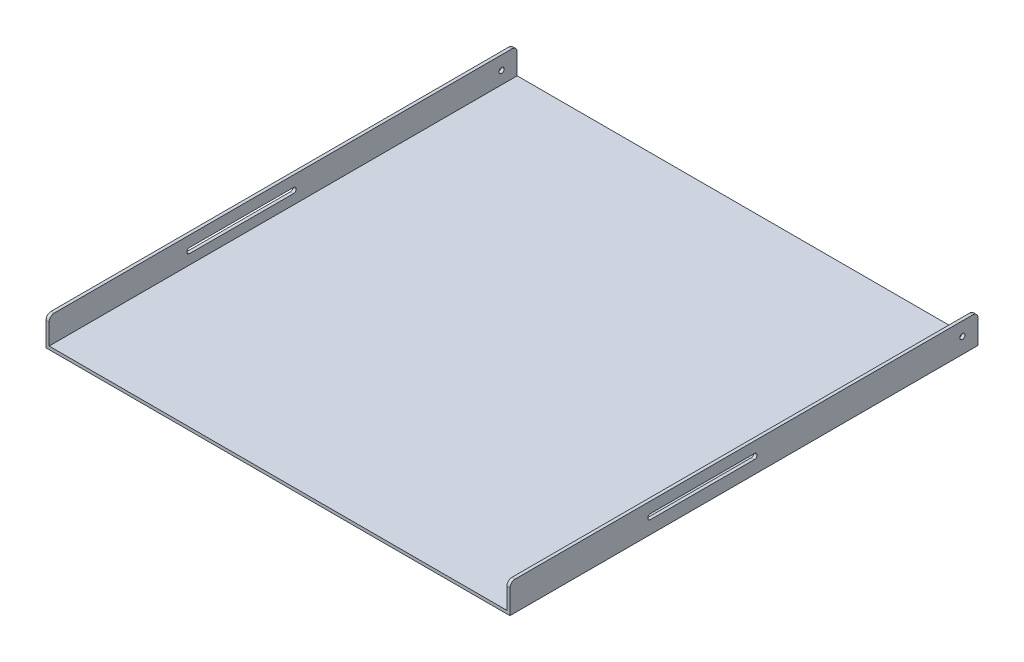
ISO-10303-21;
HEADER;
FILE_DESCRIPTION(('STEP AP214'),'2;1');
FILE_NAME('part.step','',(''),(''),'','','');
FILE_SCHEMA(('AUTOMOTIVE_DESIGN { 1 0 10303 214 1 1 1 1 }'));
ENDSEC;
DATA;
#1=APPLICATION_CONTEXT('core data for automotive mechanical design processes');
#2=APPLICATION_PROTOCOL_DEFINITION('international standard','automotive_design',2000,#1);
#3=PRODUCT_CONTEXT('',#1,'mechanical');
#4=PRODUCT('Part','Part','',(#3));
#5=PRODUCT_RELATED_PRODUCT_CATEGORY('part','',(#4));
#6=PRODUCT_DEFINITION_FORMATION('','',#4);
#7=PRODUCT_DEFINITION_CONTEXT('part definition',#1,'design');
#8=PRODUCT_DEFINITION('design','',#6,#7);
#9=PRODUCT_DEFINITION_SHAPE('','',#8);
#10=(LENGTH_UNIT() NAMED_UNIT(*) SI_UNIT(.MILLI.,.METRE.));
#11=(NAMED_UNIT(*) PLANE_ANGLE_UNIT() SI_UNIT($,.RADIAN.));
#12=(NAMED_UNIT(*) SI_UNIT($,.STERADIAN.) SOLID_ANGLE_UNIT());
#13=UNCERTAINTY_MEASURE_WITH_UNIT(LENGTH_MEASURE(1.E-05),#10,'distance_accuracy_value','');
#14=(GEOMETRIC_REPRESENTATION_CONTEXT(3) GLOBAL_UNCERTAINTY_ASSIGNED_CONTEXT((#13)) GLOBAL_UNIT_ASSIGNED_CONTEXT((#10,
#11,#12)) REPRESENTATION_CONTEXT('',''));
#15=CARTESIAN_POINT('',(0.,0.,0.));
#16=DIRECTION('',(0.,0.,1.));
#17=DIRECTION('',(1.,0.,0.));
#18=AXIS2_PLACEMENT_3D('',#15,#16,#17);
#19=CARTESIAN_POINT('',(636.,0.,450.));
#20=DIRECTION('',(-1.,0.,0.));
#21=DIRECTION('',(0.,0.,1.));
#22=AXIS2_PLACEMENT_3D('',#19,#20,#21);
#23=PLANE('',#22);
#24=CARTESIAN_POINT('',(636.,24.,-420.));
#25=DIRECTION('',(1.,0.,0.));
#26=DIRECTION('',(0.,0.,-1.));
#27=AXIS2_PLACEMENT_3D('',#24,#25,#26);
#28=CIRCLE('',#27,4.99999999999999);
#29=CARTESIAN_POINT('',(636.,24.,-425.));
#30=VERTEX_POINT('',#29);
#31=EDGE_CURVE('E213',#30,#30,#28,.T.);
#32=ORIENTED_EDGE('',*,*,#31,.F.);
#33=EDGE_LOOP('',(#32));
#34=FACE_BOUND('',#33,.T.);
#35=DIRECTION('',(0.,0.,1.));
#36=VECTOR('',#35,1.);
#37=CARTESIAN_POINT('',(636.,29.,-20.));
#38=LINE('',#37,#36);
#39=CARTESIAN_POINT('',(636.,29.,-20.));
#40=VERTEX_POINT('',#39);
#41=CARTESIAN_POINT('',(636.,29.,180.));
#42=VERTEX_POINT('',#41);
#43=EDGE_CURVE('E211',#40,#42,#38,.T.);
#44=ORIENTED_EDGE('',*,*,#43,.F.);
#45=CARTESIAN_POINT('',(636.,24.,-20.));
#46=DIRECTION('',(1.,0.,0.));
#47=DIRECTION('',(0.,0.,-1.));
#48=AXIS2_PLACEMENT_3D('',#45,#46,#47);
#49=CIRCLE('',#48,5.);
#50=CARTESIAN_POINT('',(636.,19.,-20.));
#51=VERTEX_POINT('',#50);
#52=EDGE_CURVE('E187',#51,#40,#49,.T.);
#53=ORIENTED_EDGE('',*,*,#52,.F.);
#54=DIRECTION('',(0.,0.,-1.));
#55=VECTOR('',#54,1.);
#56=CARTESIAN_POINT('',(636.,19.,-20.));
#57=LINE('',#56,#55);
#58=CARTESIAN_POINT('',(636.,19.,180.));
#59=VERTEX_POINT('',#58);
#60=EDGE_CURVE('E197',#59,#51,#57,.T.);
#61=ORIENTED_EDGE('',*,*,#60,.F.);
#62=CARTESIAN_POINT('',(636.,24.,180.));
#63=DIRECTION('',(1.,0.,0.));
#64=DIRECTION('',(0.,0.,-1.));
#65=AXIS2_PLACEMENT_3D('',#62,#63,#64);
#66=CIRCLE('',#65,5.);
#67=EDGE_CURVE('E205',#42,#59,#66,.T.);
#68=ORIENTED_EDGE('',*,*,#67,.F.);
#69=EDGE_LOOP('',(#44,#53,#61,#68));
#70=FACE_BOUND('',#69,.T.);
#71=DIRECTION('',(0.,1.,0.));
#72=VECTOR('',#71,1.);
#73=CARTESIAN_POINT('',(636.,0.,-450.));
#74=LINE('',#73,#72);
#75=CARTESIAN_POINT('',(636.,-6.,-450.));
#76=VERTEX_POINT('',#75);
#77=CARTESIAN_POINT('',(636.,40.,-450.));
#78=VERTEX_POINT('',#77);
#79=EDGE_CURVE('E272',#76,#78,#74,.T.);
#80=ORIENTED_EDGE('',*,*,#79,.T.);
#81=CARTESIAN_POINT('',(636.,40.,-440.));
#82=DIRECTION('',(-1.,0.,0.));
#83=DIRECTION('',(0.,0.,1.));
#84=AXIS2_PLACEMENT_3D('',#81,#82,#83);
#85=CIRCLE('',#84,10.);
#86=CARTESIAN_POINT('',(636.,50.,-440.));
#87=VERTEX_POINT('',#86);
#88=EDGE_CURVE('E371',#78,#87,#85,.F.);
#89=ORIENTED_EDGE('',*,*,#88,.T.);
#90=DIRECTION('',(0.,0.,-1.));
#91=VECTOR('',#90,1.);
#92=CARTESIAN_POINT('',(636.,50.,450.));
#93=LINE('',#92,#91);
#94=CARTESIAN_POINT('',(636.,50.,440.));
#95=VERTEX_POINT('',#94);
#96=EDGE_CURVE('E338',#95,#87,#93,.T.);
#97=ORIENTED_EDGE('',*,*,#96,.F.);
#98=CARTESIAN_POINT('',(636.,40.,440.));
#99=DIRECTION('',(-1.,0.,0.));
#100=DIRECTION('',(0.,0.,1.));
#101=AXIS2_PLACEMENT_3D('',#98,#99,#100);
#102=CIRCLE('',#101,10.);
#103=CARTESIAN_POINT('',(636.,40.,450.));
#104=VERTEX_POINT('',#103);
#105=EDGE_CURVE('E368',#95,#104,#102,.F.);
#106=ORIENTED_EDGE('',*,*,#105,.T.);
#107=DIRECTION('',(0.,1.,0.));
#108=VECTOR('',#107,1.);
#109=CARTESIAN_POINT('',(636.,0.,450.));
#110=LINE('',#109,#108);
#111=CARTESIAN_POINT('',(636.,-6.,450.));
#112=VERTEX_POINT('',#111);
#113=EDGE_CURVE('E273',#112,#104,#110,.T.);
#114=ORIENTED_EDGE('',*,*,#113,.F.);
#115=DIRECTION('',(0.,0.,-1.));
#116=VECTOR('',#115,1.);
#117=CARTESIAN_POINT('',(636.,-6.,450.));
#118=LINE('',#117,#116);
#119=EDGE_CURVE('E293',#112,#76,#118,.T.);
#120=ORIENTED_EDGE('',*,*,#119,.T.);
#121=EDGE_LOOP('',(#80,#89,#97,#106,#114,#120));
#122=FACE_BOUND('',#121,.T.);
#123=ADVANCED_FACE('F43',(#34,#70,#122),#23,.F.);
#124=CARTESIAN_POINT('',(630.,50.,450.));
#125=DIRECTION('',(0.,1.,0.));
#126=DIRECTION('',(0.,0.,1.));
#127=AXIS2_PLACEMENT_3D('',#124,#125,#126);
#128=PLANE('',#127);
#129=ORIENTED_EDGE('',*,*,#96,.T.);
#130=DIRECTION('',(1.,0.,0.));
#131=VECTOR('',#130,1.);
#132=CARTESIAN_POINT('',(630.,50.,-440.));
#133=LINE('',#132,#131);
#134=CARTESIAN_POINT('',(630.,50.,-440.));
#135=VERTEX_POINT('',#134);
#136=EDGE_CURVE('E66',#87,#135,#133,.F.);
#137=ORIENTED_EDGE('',*,*,#136,.T.);
#138=DIRECTION('',(0.,0.,-1.));
#139=VECTOR('',#138,1.);
#140=CARTESIAN_POINT('',(630.,50.,450.));
#141=LINE('',#140,#139);
#142=CARTESIAN_POINT('',(630.,50.,440.));
#143=VERTEX_POINT('',#142);
#144=EDGE_CURVE('E335',#143,#135,#141,.T.);
#145=ORIENTED_EDGE('',*,*,#144,.F.);
#146=DIRECTION('',(1.,0.,0.));
#147=VECTOR('',#146,1.);
#148=CARTESIAN_POINT('',(636.,50.,440.));
#149=LINE('',#148,#147);
#150=EDGE_CURVE('E374',#143,#95,#149,.T.);
#151=ORIENTED_EDGE('',*,*,#150,.T.);
#152=EDGE_LOOP('',(#129,#137,#145,#151));
#153=FACE_BOUND('',#152,.T.);
#154=ADVANCED_FACE('F420',(#153),#128,.T.);
#155=CARTESIAN_POINT('',(630.,0.,450.));
#156=DIRECTION('',(-1.,0.,0.));
#157=DIRECTION('',(0.,0.,1.));
#158=AXIS2_PLACEMENT_3D('',#155,#156,#157);
#159=PLANE('',#158);
#160=CARTESIAN_POINT('',(630.,24.,-420.));
#161=DIRECTION('',(-1.,0.,0.));
#162=DIRECTION('',(0.,0.,1.));
#163=AXIS2_PLACEMENT_3D('',#160,#161,#162);
#164=CIRCLE('',#163,4.99999999999999);
#165=CARTESIAN_POINT('',(630.,24.,-415.));
#166=VERTEX_POINT('',#165);
#167=EDGE_CURVE('E268',#166,#166,#164,.T.);
#168=ORIENTED_EDGE('',*,*,#167,.F.);
#169=EDGE_LOOP('',(#168));
#170=FACE_BOUND('',#169,.T.);
#171=CARTESIAN_POINT('',(630.,24.,-20.));
#172=DIRECTION('',(-1.,0.,0.));
#173=DIRECTION('',(0.,0.,1.));
#174=AXIS2_PLACEMENT_3D('',#171,#172,#173);
#175=CIRCLE('',#174,5.);
#176=CARTESIAN_POINT('',(630.,29.,-20.));
#177=VERTEX_POINT('',#176);
#178=CARTESIAN_POINT('',(630.,19.,-20.));
#179=VERTEX_POINT('',#178);
#180=EDGE_CURVE('E190',#177,#179,#175,.T.);
#181=ORIENTED_EDGE('',*,*,#180,.F.);
#182=DIRECTION('',(0.,0.,-1.));
#183=VECTOR('',#182,1.);
#184=CARTESIAN_POINT('',(630.,28.9999999999999,450.));
#185=LINE('',#184,#183);
#186=CARTESIAN_POINT('',(630.,29.,180.));
#187=VERTEX_POINT('',#186);
#188=EDGE_CURVE('E242',#187,#177,#185,.T.);
#189=ORIENTED_EDGE('',*,*,#188,.F.);
#190=CARTESIAN_POINT('',(630.,24.,180.));
#191=DIRECTION('',(-1.,0.,0.));
#192=DIRECTION('',(0.,0.,1.));
#193=AXIS2_PLACEMENT_3D('',#190,#191,#192);
#194=CIRCLE('',#193,5.);
#195=CARTESIAN_POINT('',(630.,19.,180.));
#196=VERTEX_POINT('',#195);
#197=EDGE_CURVE('E248',#196,#187,#194,.T.);
#198=ORIENTED_EDGE('',*,*,#197,.F.);
#199=DIRECTION('',(0.,0.,1.));
#200=VECTOR('',#199,1.);
#201=CARTESIAN_POINT('',(630.,18.9999999999999,450.));
#202=LINE('',#201,#200);
#203=EDGE_CURVE('E255',#179,#196,#202,.T.);
#204=ORIENTED_EDGE('',*,*,#203,.F.);
#205=EDGE_LOOP('',(#181,#189,#198,#204));
#206=FACE_BOUND('',#205,.T.);
#207=ORIENTED_EDGE('',*,*,#144,.T.);
#208=CARTESIAN_POINT('',(630.,40.,-440.));
#209=DIRECTION('',(-1.,0.,0.));
#210=DIRECTION('',(0.,0.,1.));
#211=AXIS2_PLACEMENT_3D('',#208,#209,#210);
#212=CIRCLE('',#211,10.);
#213=CARTESIAN_POINT('',(630.,40.,-450.));
#214=VERTEX_POINT('',#213);
#215=EDGE_CURVE('E383',#135,#214,#212,.T.);
#216=ORIENTED_EDGE('',*,*,#215,.T.);
#217=DIRECTION('',(0.,1.,0.));
#218=VECTOR('',#217,1.);
#219=CARTESIAN_POINT('',(630.,0.,-450.));
#220=LINE('',#219,#218);
#221=CARTESIAN_POINT('',(630.,0.,-450.));
#222=VERTEX_POINT('',#221);
#223=EDGE_CURVE('E297',#222,#214,#220,.T.);
#224=ORIENTED_EDGE('',*,*,#223,.F.);
#225=DIRECTION('',(0.,0.,-1.));
#226=VECTOR('',#225,1.);
#227=CARTESIAN_POINT('',(630.,0.,450.));
#228=LINE('',#227,#226);
#229=CARTESIAN_POINT('',(630.,0.,450.));
#230=VERTEX_POINT('',#229);
#231=EDGE_CURVE('E332',#230,#222,#228,.T.);
#232=ORIENTED_EDGE('',*,*,#231,.F.);
#233=DIRECTION('',(0.,1.,0.));
#234=VECTOR('',#233,1.);
#235=CARTESIAN_POINT('',(630.,0.,450.));
#236=LINE('',#235,#234);
#237=CARTESIAN_POINT('',(630.,40.,450.));
#238=VERTEX_POINT('',#237);
#239=EDGE_CURVE('E276',#230,#238,#236,.T.);
#240=ORIENTED_EDGE('',*,*,#239,.T.);
#241=CARTESIAN_POINT('',(630.,40.,440.));
#242=DIRECTION('',(-1.,0.,0.));
#243=DIRECTION('',(0.,0.,1.));
#244=AXIS2_PLACEMENT_3D('',#241,#242,#243);
#245=CIRCLE('',#244,10.);
#246=EDGE_CURVE('E380',#238,#143,#245,.T.);
#247=ORIENTED_EDGE('',*,*,#246,.T.);
#248=EDGE_LOOP('',(#207,#216,#224,#232,#240,#247));
#249=FACE_BOUND('',#248,.T.);
#250=ADVANCED_FACE('F416',(#170,#206,#249),#159,.T.);
#251=CARTESIAN_POINT('',(-250.,0.,450.));
#252=DIRECTION('',(0.,1.,0.));
#253=DIRECTION('',(0.,0.,1.));
#254=AXIS2_PLACEMENT_3D('',#251,#252,#253);
#255=PLANE('',#254);
#256=DIRECTION('',(1.,0.,0.));
#257=VECTOR('',#256,1.);
#258=CARTESIAN_POINT('',(-250.,0.,-450.));
#259=LINE('',#258,#257);
#260=CARTESIAN_POINT('',(-250.,0.,-450.));
#261=VERTEX_POINT('',#260);
#262=EDGE_CURVE('E301',#261,#222,#259,.T.);
#263=ORIENTED_EDGE('',*,*,#262,.F.);
#264=DIRECTION('',(0.,0.,-1.));
#265=VECTOR('',#264,1.);
#266=CARTESIAN_POINT('',(-250.,0.,450.));
#267=LINE('',#266,#265);
#268=CARTESIAN_POINT('',(-250.,0.,450.));
#269=VERTEX_POINT('',#268);
#270=EDGE_CURVE('E328',#269,#261,#267,.T.);
#271=ORIENTED_EDGE('',*,*,#270,.F.);
#272=DIRECTION('',(1.,0.,0.));
#273=VECTOR('',#272,1.);
#274=CARTESIAN_POINT('',(-250.,0.,450.));
#275=LINE('',#274,#273);
#276=EDGE_CURVE('E280',#269,#230,#275,.T.);
#277=ORIENTED_EDGE('',*,*,#276,.T.);
#278=ORIENTED_EDGE('',*,*,#231,.T.);
#279=EDGE_LOOP('',(#263,#271,#277,#278));
#280=FACE_BOUND('',#279,.T.);
#281=ADVANCED_FACE('F419',(#280),#255,.T.);
#282=CARTESIAN_POINT('',(-250.,50.,450.));
#283=DIRECTION('',(1.,0.,0.));
#284=DIRECTION('',(0.,0.,-1.));
#285=AXIS2_PLACEMENT_3D('',#282,#283,#284);
#286=PLANE('',#285);
#287=CARTESIAN_POINT('',(-250.,24.,-420.));
#288=DIRECTION('',(1.,0.,0.));
#289=DIRECTION('',(0.,0.,-1.));
#290=AXIS2_PLACEMENT_3D('',#287,#288,#289);
#291=CIRCLE('',#290,4.99999999999999);
#292=CARTESIAN_POINT('',(-250.,24.,-425.));
#293=VERTEX_POINT('',#292);
#294=EDGE_CURVE('E264',#293,#293,#291,.T.);
#295=ORIENTED_EDGE('',*,*,#294,.F.);
#296=EDGE_LOOP('',(#295));
#297=FACE_BOUND('',#296,.T.);
#298=CARTESIAN_POINT('',(-250.,24.,-20.));
#299=DIRECTION('',(1.,0.,0.));
#300=DIRECTION('',(0.,0.,-1.));
#301=AXIS2_PLACEMENT_3D('',#298,#299,#300);
#302=CIRCLE('',#301,5.);
#303=CARTESIAN_POINT('',(-250.,19.,-20.));
#304=VERTEX_POINT('',#303);
#305=CARTESIAN_POINT('',(-250.,29.,-20.));
#306=VERTEX_POINT('',#305);
#307=EDGE_CURVE('E258',#304,#306,#302,.T.);
#308=ORIENTED_EDGE('',*,*,#307,.F.);
#309=DIRECTION('',(0.,0.,-1.));
#310=VECTOR('',#309,1.);
#311=CARTESIAN_POINT('',(-250.,18.9999999999999,450.));
#312=LINE('',#311,#310);
#313=CARTESIAN_POINT('',(-250.,19.,180.));
#314=VERTEX_POINT('',#313);
#315=EDGE_CURVE('E252',#314,#304,#312,.T.);
#316=ORIENTED_EDGE('',*,*,#315,.F.);
#317=CARTESIAN_POINT('',(-250.,24.,180.));
#318=DIRECTION('',(1.,0.,0.));
#319=DIRECTION('',(0.,0.,-1.));
#320=AXIS2_PLACEMENT_3D('',#317,#318,#319);
#321=CIRCLE('',#320,5.);
#322=CARTESIAN_POINT('',(-250.,29.,180.));
#323=VERTEX_POINT('',#322);
#324=EDGE_CURVE('E245',#323,#314,#321,.T.);
#325=ORIENTED_EDGE('',*,*,#324,.F.);
#326=DIRECTION('',(0.,0.,1.));
#327=VECTOR('',#326,1.);
#328=CARTESIAN_POINT('',(-250.,28.9999999999999,450.));
#329=LINE('',#328,#327);
#330=EDGE_CURVE('E239',#306,#323,#329,.T.);
#331=ORIENTED_EDGE('',*,*,#330,.F.);
#332=EDGE_LOOP('',(#308,#316,#325,#331));
#333=FACE_BOUND('',#332,.T.);
#334=DIRECTION('',(0.,-1.,0.));
#335=VECTOR('',#334,1.);
#336=CARTESIAN_POINT('',(-250.,50.,-450.));
#337=LINE('',#336,#335);
#338=CARTESIAN_POINT('',(-250.,40.,-450.));
#339=VERTEX_POINT('',#338);
#340=EDGE_CURVE('E305',#339,#261,#337,.T.);
#341=ORIENTED_EDGE('',*,*,#340,.F.);
#342=CARTESIAN_POINT('',(-250.,40.,-440.));
#343=DIRECTION('',(1.,0.,0.));
#344=DIRECTION('',(0.,0.,-1.));
#345=AXIS2_PLACEMENT_3D('',#342,#343,#344);
#346=CIRCLE('',#345,10.);
#347=CARTESIAN_POINT('',(-250.,50.,-440.));
#348=VERTEX_POINT('',#347);
#349=EDGE_CURVE('E352',#339,#348,#346,.T.);
#350=ORIENTED_EDGE('',*,*,#349,.T.);
#351=DIRECTION('',(0.,0.,-1.));
#352=VECTOR('',#351,1.);
#353=CARTESIAN_POINT('',(-250.,50.,450.));
#354=LINE('',#353,#352);
#355=CARTESIAN_POINT('',(-250.,50.,440.));
#356=VERTEX_POINT('',#355);
#357=EDGE_CURVE('E324',#356,#348,#354,.T.);
#358=ORIENTED_EDGE('',*,*,#357,.F.);
#359=CARTESIAN_POINT('',(-250.,40.,440.));
#360=DIRECTION('',(1.,0.,0.));
#361=DIRECTION('',(0.,0.,-1.));
#362=AXIS2_PLACEMENT_3D('',#359,#360,#361);
#363=CIRCLE('',#362,10.);
#364=CARTESIAN_POINT('',(-250.,40.,450.));
#365=VERTEX_POINT('',#364);
#366=EDGE_CURVE('E349',#356,#365,#363,.T.);
#367=ORIENTED_EDGE('',*,*,#366,.T.);
#368=DIRECTION('',(0.,-1.,0.));
#369=VECTOR('',#368,1.);
#370=CARTESIAN_POINT('',(-250.,50.,450.));
#371=LINE('',#370,#369);
#372=EDGE_CURVE('E284',#365,#269,#371,.T.);
#373=ORIENTED_EDGE('',*,*,#372,.T.);
#374=ORIENTED_EDGE('',*,*,#270,.T.);
#375=EDGE_LOOP('',(#341,#350,#358,#367,#373,#374));
#376=FACE_BOUND('',#375,.T.);
#377=ADVANCED_FACE('F451',(#297,#333,#376),#286,.T.);
#378=CARTESIAN_POINT('',(-256.,50.,450.));
#379=DIRECTION('',(0.,1.,0.));
#380=DIRECTION('',(0.,0.,1.));
#381=AXIS2_PLACEMENT_3D('',#378,#379,#380);
#382=PLANE('',#381);
#383=ORIENTED_EDGE('',*,*,#357,.T.);
#384=DIRECTION('',(1.,0.,0.));
#385=VECTOR('',#384,1.);
#386=CARTESIAN_POINT('',(-256.,50.,-440.));
#387=LINE('',#386,#385);
#388=CARTESIAN_POINT('',(-256.,50.,-440.));
#389=VERTEX_POINT('',#388);
#390=EDGE_CURVE('E359',#348,#389,#387,.F.);
#391=ORIENTED_EDGE('',*,*,#390,.T.);
#392=DIRECTION('',(0.,0.,-1.));
#393=VECTOR('',#392,1.);
#394=CARTESIAN_POINT('',(-256.,50.,450.));
#395=LINE('',#394,#393);
#396=CARTESIAN_POINT('',(-256.,50.,440.));
#397=VERTEX_POINT('',#396);
#398=EDGE_CURVE('E320',#397,#389,#395,.T.);
#399=ORIENTED_EDGE('',*,*,#398,.F.);
#400=DIRECTION('',(1.,0.,0.));
#401=VECTOR('',#400,1.);
#402=CARTESIAN_POINT('',(-250.,50.,440.));
#403=LINE('',#402,#401);
#404=EDGE_CURVE('E355',#397,#356,#403,.T.);
#405=ORIENTED_EDGE('',*,*,#404,.T.);
#406=EDGE_LOOP('',(#383,#391,#399,#405));
#407=FACE_BOUND('',#406,.T.);
#408=ADVANCED_FACE('F453',(#407),#382,.T.);
#409=CARTESIAN_POINT('',(-256.,50.,450.));
#410=DIRECTION('',(1.,0.,0.));
#411=DIRECTION('',(0.,0.,-1.));
#412=AXIS2_PLACEMENT_3D('',#409,#410,#411);
#413=PLANE('',#412);
#414=CARTESIAN_POINT('',(-256.,24.,-420.));
#415=DIRECTION('',(1.,0.,0.));
#416=DIRECTION('',(0.,0.,-1.));
#417=AXIS2_PLACEMENT_3D('',#414,#415,#416);
#418=CIRCLE('',#417,4.99999999999999);
#419=CARTESIAN_POINT('',(-256.,24.,-425.));
#420=VERTEX_POINT('',#419);
#421=EDGE_CURVE('E218',#420,#420,#418,.T.);
#422=ORIENTED_EDGE('',*,*,#421,.T.);
#423=EDGE_LOOP('',(#422));
#424=FACE_BOUND('',#423,.T.);
#425=DIRECTION('',(0.,0.,-1.));
#426=VECTOR('',#425,1.);
#427=CARTESIAN_POINT('',(-256.,19.,-20.));
#428=LINE('',#427,#426);
#429=CARTESIAN_POINT('',(-256.,19.,180.));
#430=VERTEX_POINT('',#429);
#431=CARTESIAN_POINT('',(-256.,19.,-20.));
#432=VERTEX_POINT('',#431);
#433=EDGE_CURVE('E223',#430,#432,#428,.T.);
#434=ORIENTED_EDGE('',*,*,#433,.T.);
#435=CARTESIAN_POINT('',(-256.,24.,-20.));
#436=DIRECTION('',(1.,0.,0.));
#437=DIRECTION('',(0.,0.,-1.));
#438=AXIS2_PLACEMENT_3D('',#435,#436,#437);
#439=CIRCLE('',#438,5.);
#440=CARTESIAN_POINT('',(-256.,29.,-20.));
#441=VERTEX_POINT('',#440);
#442=EDGE_CURVE('E206',#432,#441,#439,.T.);
#443=ORIENTED_EDGE('',*,*,#442,.T.);
#444=DIRECTION('',(0.,0.,1.));
#445=VECTOR('',#444,1.);
#446=CARTESIAN_POINT('',(-256.,29.,-20.));
#447=LINE('',#446,#445);
#448=CARTESIAN_POINT('',(-256.,29.,180.));
#449=VERTEX_POINT('',#448);
#450=EDGE_CURVE('E232',#441,#449,#447,.T.);
#451=ORIENTED_EDGE('',*,*,#450,.T.);
#452=CARTESIAN_POINT('',(-256.,24.,180.));
#453=DIRECTION('',(1.,0.,0.));
#454=DIRECTION('',(0.,0.,-1.));
#455=AXIS2_PLACEMENT_3D('',#452,#453,#454);
#456=CIRCLE('',#455,5.);
#457=EDGE_CURVE('E227',#449,#430,#456,.T.);
#458=ORIENTED_EDGE('',*,*,#457,.T.);
#459=EDGE_LOOP('',(#434,#443,#451,#458));
#460=FACE_BOUND('',#459,.T.);
#461=ORIENTED_EDGE('',*,*,#398,.T.);
#462=CARTESIAN_POINT('',(-256.,40.,-440.));
#463=DIRECTION('',(1.,0.,0.));
#464=DIRECTION('',(0.,0.,-1.));
#465=AXIS2_PLACEMENT_3D('',#462,#463,#464);
#466=CIRCLE('',#465,10.);
#467=CARTESIAN_POINT('',(-256.,40.,-450.));
#468=VERTEX_POINT('',#467);
#469=EDGE_CURVE('E365',#389,#468,#466,.F.);
#470=ORIENTED_EDGE('',*,*,#469,.T.);
#471=DIRECTION('',(0.,1.,0.));
#472=VECTOR('',#471,1.);
#473=CARTESIAN_POINT('',(-256.,50.,-450.));
#474=LINE('',#473,#472);
#475=CARTESIAN_POINT('',(-256.,-6.,-450.));
#476=VERTEX_POINT('',#475);
#477=EDGE_CURVE('E308',#468,#476,#474,.F.);
#478=ORIENTED_EDGE('',*,*,#477,.T.);
#479=DIRECTION('',(0.,0.,-1.));
#480=VECTOR('',#479,1.);
#481=CARTESIAN_POINT('',(-256.,-6.,450.));
#482=LINE('',#481,#480);
#483=CARTESIAN_POINT('',(-256.,-6.,450.));
#484=VERTEX_POINT('',#483);
#485=EDGE_CURVE('E316',#484,#476,#482,.T.);
#486=ORIENTED_EDGE('',*,*,#485,.F.);
#487=DIRECTION('',(0.,1.,0.));
#488=VECTOR('',#487,1.);
#489=CARTESIAN_POINT('',(-256.,50.,450.));
#490=LINE('',#489,#488);
#491=CARTESIAN_POINT('',(-256.,40.,450.));
#492=VERTEX_POINT('',#491);
#493=EDGE_CURVE('E287',#492,#484,#490,.F.);
#494=ORIENTED_EDGE('',*,*,#493,.F.);
#495=CARTESIAN_POINT('',(-256.,40.,440.));
#496=DIRECTION('',(1.,0.,0.));
#497=DIRECTION('',(0.,0.,-1.));
#498=AXIS2_PLACEMENT_3D('',#495,#496,#497);
#499=CIRCLE('',#498,10.);
#500=EDGE_CURVE('E362',#492,#397,#499,.F.);
#501=ORIENTED_EDGE('',*,*,#500,.T.);
#502=EDGE_LOOP('',(#461,#470,#478,#486,#494,#501));
#503=FACE_BOUND('',#502,.T.);
#504=ADVANCED_FACE('F468',(#424,#460,#503),#413,.F.);
#505=CARTESIAN_POINT('',(-250.,-6.,450.));
#506=DIRECTION('',(0.,1.,0.));
#507=DIRECTION('',(0.,0.,1.));
#508=AXIS2_PLACEMENT_3D('',#505,#506,#507);
#509=PLANE('',#508);
#510=DIRECTION('',(1.,0.,0.));
#511=VECTOR('',#510,1.);
#512=CARTESIAN_POINT('',(-250.,-6.,-450.));
#513=LINE('',#512,#511);
#514=EDGE_CURVE('E277',#476,#76,#513,.T.);
#515=ORIENTED_EDGE('',*,*,#514,.T.);
#516=ORIENTED_EDGE('',*,*,#119,.F.);
#517=DIRECTION('',(1.,0.,0.));
#518=VECTOR('',#517,1.);
#519=CARTESIAN_POINT('',(-250.,-6.,450.));
#520=LINE('',#519,#518);
#521=EDGE_CURVE('E290',#484,#112,#520,.T.);
#522=ORIENTED_EDGE('',*,*,#521,.F.);
#523=ORIENTED_EDGE('',*,*,#485,.T.);
#524=EDGE_LOOP('',(#515,#516,#522,#523));
#525=FACE_BOUND('',#524,.T.);
#526=ADVANCED_FACE('F440',(#525),#509,.F.);
#527=CARTESIAN_POINT('',(0.,0.,450.));
#528=DIRECTION('',(0.,0.,-1.));
#529=DIRECTION('',(-1.,0.,0.));
#530=AXIS2_PLACEMENT_3D('',#527,#528,#529);
#531=PLANE('',#530);
#532=ORIENTED_EDGE('',*,*,#372,.F.);
#533=DIRECTION('',(1.,0.,0.));
#534=VECTOR('',#533,1.);
#535=CARTESIAN_POINT('',(-256.,40.,450.));
#536=LINE('',#535,#534);
#537=EDGE_CURVE('E11',#365,#492,#536,.F.);
#538=ORIENTED_EDGE('',*,*,#537,.T.);
#539=ORIENTED_EDGE('',*,*,#493,.T.);
#540=ORIENTED_EDGE('',*,*,#521,.T.);
#541=ORIENTED_EDGE('',*,*,#113,.T.);
#542=DIRECTION('',(1.,0.,0.));
#543=VECTOR('',#542,1.);
#544=CARTESIAN_POINT('',(630.,40.,450.));
#545=LINE('',#544,#543);
#546=EDGE_CURVE('E52',#104,#238,#545,.F.);
#547=ORIENTED_EDGE('',*,*,#546,.T.);
#548=ORIENTED_EDGE('',*,*,#239,.F.);
#549=ORIENTED_EDGE('',*,*,#276,.F.);
#550=EDGE_LOOP('',(#532,#538,#539,#540,#541,#547,#548,#549));
#551=FACE_BOUND('',#550,.T.);
#552=ADVANCED_FACE('F463',(#551),#531,.F.);
#553=CARTESIAN_POINT('',(0.,0.,-450.));
#554=DIRECTION('',(0.,0.,-1.));
#555=DIRECTION('',(-1.,0.,0.));
#556=AXIS2_PLACEMENT_3D('',#553,#554,#555);
#557=PLANE('',#556);
#558=ORIENTED_EDGE('',*,*,#477,.F.);
#559=DIRECTION('',(1.,0.,0.));
#560=VECTOR('',#559,1.);
#561=CARTESIAN_POINT('',(0.,40.,-450.));
#562=LINE('',#561,#560);
#563=EDGE_CURVE('E345',#468,#339,#562,.T.);
#564=ORIENTED_EDGE('',*,*,#563,.T.);
#565=ORIENTED_EDGE('',*,*,#340,.T.);
#566=ORIENTED_EDGE('',*,*,#262,.T.);
#567=ORIENTED_EDGE('',*,*,#223,.T.);
#568=DIRECTION('',(1.,0.,0.));
#569=VECTOR('',#568,1.);
#570=CARTESIAN_POINT('',(0.,40.,-450.));
#571=LINE('',#570,#569);
#572=EDGE_CURVE('E341',#214,#78,#571,.T.);
#573=ORIENTED_EDGE('',*,*,#572,.T.);
#574=ORIENTED_EDGE('',*,*,#79,.F.);
#575=ORIENTED_EDGE('',*,*,#514,.F.);
#576=EDGE_LOOP('',(#558,#564,#565,#566,#567,#573,#574,#575));
#577=FACE_BOUND('',#576,.T.);
#578=ADVANCED_FACE('F433',(#577),#557,.T.);
#579=CARTESIAN_POINT('',(-256.,29.,-20.));
#580=DIRECTION('',(0.,1.,0.));
#581=DIRECTION('',(0.,0.,1.));
#582=AXIS2_PLACEMENT_3D('',#579,#580,#581);
#583=PLANE('',#582);
#584=ORIENTED_EDGE('',*,*,#330,.T.);
#585=DIRECTION('',(1.,0.,0.));
#586=VECTOR('',#585,1.);
#587=CARTESIAN_POINT('',(-256.,29.,180.));
#588=LINE('',#587,#586);
#589=EDGE_CURVE('E395',#449,#323,#588,.T.);
#590=ORIENTED_EDGE('',*,*,#589,.F.);
#591=ORIENTED_EDGE('',*,*,#450,.F.);
#592=DIRECTION('',(1.,0.,0.));
#593=VECTOR('',#592,1.);
#594=CARTESIAN_POINT('',(-256.,29.,-20.));
#595=LINE('',#594,#593);
#596=EDGE_CURVE('E228',#441,#306,#595,.T.);
#597=ORIENTED_EDGE('',*,*,#596,.T.);
#598=EDGE_LOOP('',(#584,#590,#591,#597));
#599=FACE_BOUND('',#598,.T.);
#600=ADVANCED_FACE('F528',(#599),#583,.F.);
#601=CARTESIAN_POINT('',(-256.,24.,180.));
#602=DIRECTION('',(1.,0.,0.));
#603=DIRECTION('',(0.,0.,-1.));
#604=AXIS2_PLACEMENT_3D('',#601,#602,#603);
#605=CYLINDRICAL_SURFACE('',#604,5.);
#606=ORIENTED_EDGE('',*,*,#324,.T.);
#607=DIRECTION('',(1.,0.,0.));
#608=VECTOR('',#607,1.);
#609=CARTESIAN_POINT('',(-256.,19.,180.));
#610=LINE('',#609,#608);
#611=EDGE_CURVE('E400',#430,#314,#610,.T.);
#612=ORIENTED_EDGE('',*,*,#611,.F.);
#613=ORIENTED_EDGE('',*,*,#457,.F.);
#614=ORIENTED_EDGE('',*,*,#589,.T.);
#615=EDGE_LOOP('',(#606,#612,#613,#614));
#616=FACE_BOUND('',#615,.T.);
#617=ADVANCED_FACE('F612',(#616),#605,.F.);
#618=CARTESIAN_POINT('',(-256.,19.,-20.));
#619=DIRECTION('',(0.,-1.,0.));
#620=DIRECTION('',(0.,0.,-1.));
#621=AXIS2_PLACEMENT_3D('',#618,#619,#620);
#622=PLANE('',#621);
#623=ORIENTED_EDGE('',*,*,#315,.T.);
#624=DIRECTION('',(1.,0.,0.));
#625=VECTOR('',#624,1.);
#626=CARTESIAN_POINT('',(-256.,19.,-20.));
#627=LINE('',#626,#625);
#628=EDGE_CURVE('E194',#432,#304,#627,.T.);
#629=ORIENTED_EDGE('',*,*,#628,.F.);
#630=ORIENTED_EDGE('',*,*,#433,.F.);
#631=ORIENTED_EDGE('',*,*,#611,.T.);
#632=EDGE_LOOP('',(#623,#629,#630,#631));
#633=FACE_BOUND('',#632,.T.);
#634=ADVANCED_FACE('F622',(#633),#622,.F.);
#635=CARTESIAN_POINT('',(-256.,24.,-20.));
#636=DIRECTION('',(1.,0.,0.));
#637=DIRECTION('',(0.,0.,-1.));
#638=AXIS2_PLACEMENT_3D('',#635,#636,#637);
#639=CYLINDRICAL_SURFACE('',#638,5.);
#640=ORIENTED_EDGE('',*,*,#307,.T.);
#641=ORIENTED_EDGE('',*,*,#596,.F.);
#642=ORIENTED_EDGE('',*,*,#442,.F.);
#643=ORIENTED_EDGE('',*,*,#628,.T.);
#644=EDGE_LOOP('',(#640,#641,#642,#643));
#645=FACE_BOUND('',#644,.T.);
#646=ADVANCED_FACE('F632',(#645),#639,.F.);
#647=CARTESIAN_POINT('',(-256.,24.,-420.));
#648=DIRECTION('',(1.,0.,0.));
#649=DIRECTION('',(0.,0.,-1.));
#650=AXIS2_PLACEMENT_3D('',#647,#648,#649);
#651=CYLINDRICAL_SURFACE('',#650,4.99999999999999);
#652=ORIENTED_EDGE('',*,*,#294,.T.);
#653=EDGE_LOOP('',(#652));
#654=FACE_BOUND('',#653,.T.);
#655=ORIENTED_EDGE('',*,*,#421,.F.);
#656=EDGE_LOOP('',(#655));
#657=FACE_BOUND('',#656,.T.);
#658=ADVANCED_FACE('F593',(#654,#657),#651,.F.);
#659=ORIENTED_EDGE('',*,*,#180,.T.);
#660=EDGE_CURVE('E182',#179,#51,#627,.T.);
#661=ORIENTED_EDGE('',*,*,#660,.T.);
#662=ORIENTED_EDGE('',*,*,#52,.T.);
#663=EDGE_CURVE('E394',#177,#40,#595,.T.);
#664=ORIENTED_EDGE('',*,*,#663,.F.);
#665=EDGE_LOOP('',(#659,#661,#662,#664));
#666=FACE_BOUND('',#665,.T.);
#667=ADVANCED_FACE('F184',(#666),#639,.F.);
#668=ORIENTED_EDGE('',*,*,#203,.T.);
#669=EDGE_CURVE('E200',#196,#59,#610,.T.);
#670=ORIENTED_EDGE('',*,*,#669,.T.);
#671=ORIENTED_EDGE('',*,*,#60,.T.);
#672=ORIENTED_EDGE('',*,*,#660,.F.);
#673=EDGE_LOOP('',(#668,#670,#671,#672));
#674=FACE_BOUND('',#673,.T.);
#675=ADVANCED_FACE('F198',(#674),#622,.F.);
#676=ORIENTED_EDGE('',*,*,#197,.T.);
#677=EDGE_CURVE('E399',#187,#42,#588,.T.);
#678=ORIENTED_EDGE('',*,*,#677,.T.);
#679=ORIENTED_EDGE('',*,*,#67,.T.);
#680=ORIENTED_EDGE('',*,*,#669,.F.);
#681=EDGE_LOOP('',(#676,#678,#679,#680));
#682=FACE_BOUND('',#681,.T.);
#683=ADVANCED_FACE('F407',(#682),#605,.F.);
#684=ORIENTED_EDGE('',*,*,#188,.T.);
#685=ORIENTED_EDGE('',*,*,#663,.T.);
#686=ORIENTED_EDGE('',*,*,#43,.T.);
#687=ORIENTED_EDGE('',*,*,#677,.F.);
#688=EDGE_LOOP('',(#684,#685,#686,#687));
#689=FACE_BOUND('',#688,.T.);
#690=ADVANCED_FACE('F412',(#689),#583,.F.);
#691=ORIENTED_EDGE('',*,*,#167,.T.);
#692=EDGE_LOOP('',(#691));
#693=FACE_BOUND('',#692,.T.);
#694=ORIENTED_EDGE('',*,*,#31,.T.);
#695=EDGE_LOOP('',(#694));
#696=FACE_BOUND('',#695,.T.);
#697=ADVANCED_FACE('F489',(#693,#696),#651,.F.);
#698=CARTESIAN_POINT('',(0.,40.,-440.));
#699=DIRECTION('',(1.,0.,0.));
#700=DIRECTION('',(0.,0.,-1.));
#701=AXIS2_PLACEMENT_3D('',#698,#699,#700);
#702=CYLINDRICAL_SURFACE('',#701,10.);
#703=ORIENTED_EDGE('',*,*,#469,.F.);
#704=ORIENTED_EDGE('',*,*,#390,.F.);
#705=ORIENTED_EDGE('',*,*,#349,.F.);
#706=ORIENTED_EDGE('',*,*,#563,.F.);
#707=EDGE_LOOP('',(#703,#704,#705,#706));
#708=FACE_BOUND('',#707,.T.);
#709=ADVANCED_FACE('F447',(#708),#702,.T.);
#710=CARTESIAN_POINT('',(0.,40.,-440.));
#711=DIRECTION('',(1.,0.,0.));
#712=DIRECTION('',(0.,0.,-1.));
#713=AXIS2_PLACEMENT_3D('',#710,#711,#712);
#714=CYLINDRICAL_SURFACE('',#713,10.);
#715=ORIENTED_EDGE('',*,*,#215,.F.);
#716=ORIENTED_EDGE('',*,*,#136,.F.);
#717=ORIENTED_EDGE('',*,*,#88,.F.);
#718=ORIENTED_EDGE('',*,*,#572,.F.);
#719=EDGE_LOOP('',(#715,#716,#717,#718));
#720=FACE_BOUND('',#719,.T.);
#721=ADVANCED_FACE('F429',(#720),#714,.T.);
#722=CARTESIAN_POINT('',(-256.,40.,440.));
#723=DIRECTION('',(-1.,0.,0.));
#724=DIRECTION('',(0.,0.,1.));
#725=AXIS2_PLACEMENT_3D('',#722,#723,#724);
#726=CYLINDRICAL_SURFACE('',#725,10.);
#727=ORIENTED_EDGE('',*,*,#500,.F.);
#728=ORIENTED_EDGE('',*,*,#537,.F.);
#729=ORIENTED_EDGE('',*,*,#366,.F.);
#730=ORIENTED_EDGE('',*,*,#404,.F.);
#731=EDGE_LOOP('',(#727,#728,#729,#730));
#732=FACE_BOUND('',#731,.T.);
#733=ADVANCED_FACE('F458',(#732),#726,.T.);
#734=CARTESIAN_POINT('',(630.,40.,440.));
#735=DIRECTION('',(-1.,0.,0.));
#736=DIRECTION('',(0.,0.,1.));
#737=AXIS2_PLACEMENT_3D('',#734,#735,#736);
#738=CYLINDRICAL_SURFACE('',#737,10.);
#739=ORIENTED_EDGE('',*,*,#246,.F.);
#740=ORIENTED_EDGE('',*,*,#546,.F.);
#741=ORIENTED_EDGE('',*,*,#105,.F.);
#742=ORIENTED_EDGE('',*,*,#150,.F.);
#743=EDGE_LOOP('',(#739,#740,#741,#742));
#744=FACE_BOUND('',#743,.T.);
#745=ADVANCED_FACE('F45',(#744),#738,.T.);
#746=CLOSED_SHELL('',(#123,#154,#250,#281,#377,#408,#504,#526,#552,#578,#600,#617,#634,#646,
#658,#667,#675,#683,#690,#697,#709,#721,#733,#745));
#747=MANIFOLD_SOLID_BREP('B2',#746);
#748=ADVANCED_BREP_SHAPE_REPRESENTATION('',(#18,#747),#14);
#749=SHAPE_DEFINITION_REPRESENTATION(#9,#748);
ENDSEC;
END-ISO-10303-21;
